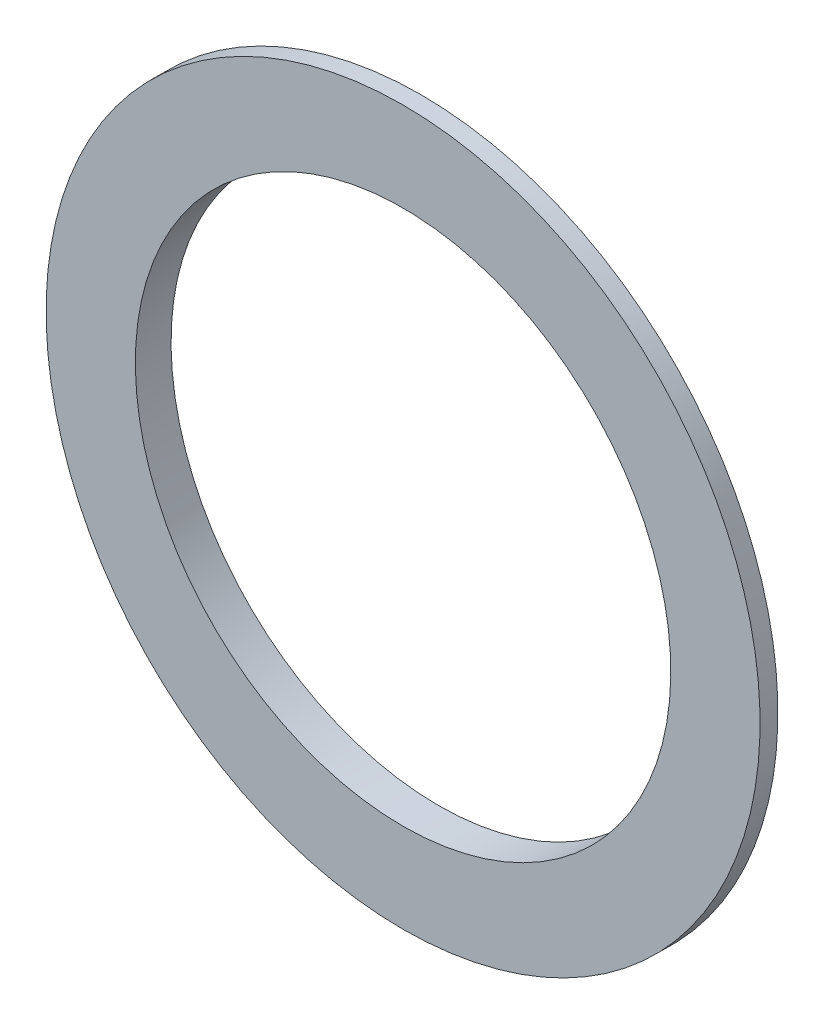
ISO-10303-21;
HEADER;
FILE_DESCRIPTION(('STEP AP214'),'2;1');
FILE_NAME('part.step','',(''),(''),'','','');
FILE_SCHEMA(('AUTOMOTIVE_DESIGN { 1 0 10303 214 1 1 1 1 }'));
ENDSEC;
DATA;
#1=APPLICATION_CONTEXT('core data for automotive mechanical design processes');
#2=APPLICATION_PROTOCOL_DEFINITION('international standard','automotive_design',2000,#1);
#3=PRODUCT_CONTEXT('',#1,'mechanical');
#4=PRODUCT('Part','Part','',(#3));
#5=PRODUCT_RELATED_PRODUCT_CATEGORY('part','',(#4));
#6=PRODUCT_DEFINITION_FORMATION('','',#4);
#7=PRODUCT_DEFINITION_CONTEXT('part definition',#1,'design');
#8=PRODUCT_DEFINITION('design','',#6,#7);
#9=PRODUCT_DEFINITION_SHAPE('','',#8);
#10=(LENGTH_UNIT() NAMED_UNIT(*) SI_UNIT(.MILLI.,.METRE.));
#11=(NAMED_UNIT(*) PLANE_ANGLE_UNIT() SI_UNIT($,.RADIAN.));
#12=(NAMED_UNIT(*) SI_UNIT($,.STERADIAN.) SOLID_ANGLE_UNIT());
#13=UNCERTAINTY_MEASURE_WITH_UNIT(LENGTH_MEASURE(1.E-05),#10,'distance_accuracy_value','');
#14=(GEOMETRIC_REPRESENTATION_CONTEXT(3) GLOBAL_UNCERTAINTY_ASSIGNED_CONTEXT((#13)) GLOBAL_UNIT_ASSIGNED_CONTEXT((#10,
#11,#12)) REPRESENTATION_CONTEXT('',''));
#15=CARTESIAN_POINT('',(0.,0.,0.));
#16=DIRECTION('',(0.,0.,1.));
#17=DIRECTION('',(1.,0.,0.));
#18=AXIS2_PLACEMENT_3D('',#15,#16,#17);
#19=CARTESIAN_POINT('',(0.,47.625,3.175));
#20=DIRECTION('',(0.,0.,-1.));
#21=DIRECTION('',(0.,1.,0.));
#22=AXIS2_PLACEMENT_3D('',#19,#20,#21);
#23=PLANE('',#22);
#24=CARTESIAN_POINT('',(0.,0.,3.17499999999999));
#25=DIRECTION('',(0.,0.,1.));
#26=DIRECTION('',(0.,-1.,0.));
#27=AXIS2_PLACEMENT_3D('',#24,#25,#26);
#28=CIRCLE('',#27,47.625);
#29=CARTESIAN_POINT('',(0.,-47.625,3.17499999999998));
#30=VERTEX_POINT('',#29);
#31=EDGE_CURVE('E65',#30,#30,#28,.T.);
#32=ORIENTED_EDGE('',*,*,#31,.F.);
#33=EDGE_LOOP('',(#32));
#34=FACE_BOUND('',#33,.T.);
#35=CARTESIAN_POINT('',(0.,0.,3.17499999999999));
#36=DIRECTION('',(0.,0.,1.));
#37=DIRECTION('',(0.,-1.,0.));
#38=AXIS2_PLACEMENT_3D('',#35,#36,#37);
#39=CIRCLE('',#38,63.5);
#40=CARTESIAN_POINT('',(0.,-63.5,3.17499999999998));
#41=VERTEX_POINT('',#40);
#42=EDGE_CURVE('E10',#41,#41,#39,.T.);
#43=ORIENTED_EDGE('',*,*,#42,.T.);
#44=EDGE_LOOP('',(#43));
#45=FACE_BOUND('',#44,.T.);
#46=ADVANCED_FACE('F31',(#34,#45),#23,.F.);
#47=CARTESIAN_POINT('',(0.,0.,3.175));
#48=DIRECTION('',(0.,0.,1.));
#49=DIRECTION('',(0.,-1.,0.));
#50=AXIS2_PLACEMENT_3D('',#47,#48,#49);
#51=CYLINDRICAL_SURFACE('',#50,63.5);
#52=ORIENTED_EDGE('',*,*,#42,.F.);
#53=EDGE_LOOP('',(#52));
#54=FACE_BOUND('',#53,.T.);
#55=CARTESIAN_POINT('',(0.,0.,0.));
#56=DIRECTION('',(0.,0.,1.));
#57=DIRECTION('',(0.,-1.,0.));
#58=AXIS2_PLACEMENT_3D('',#55,#56,#57);
#59=CIRCLE('',#58,63.5);
#60=CARTESIAN_POINT('',(0.,-63.5,0.));
#61=VERTEX_POINT('',#60);
#62=EDGE_CURVE('E37',#61,#61,#59,.T.);
#63=ORIENTED_EDGE('',*,*,#62,.T.);
#64=EDGE_LOOP('',(#63));
#65=FACE_BOUND('',#64,.T.);
#66=ADVANCED_FACE('F72',(#54,#65),#51,.T.);
#67=CARTESIAN_POINT('',(0.,63.5,0.));
#68=DIRECTION('',(0.,0.,1.));
#69=DIRECTION('',(0.,-1.,0.));
#70=AXIS2_PLACEMENT_3D('',#67,#68,#69);
#71=PLANE('',#70);
#72=ORIENTED_EDGE('',*,*,#62,.F.);
#73=EDGE_LOOP('',(#72));
#74=FACE_BOUND('',#73,.T.);
#75=CARTESIAN_POINT('',(0.,0.,0.));
#76=DIRECTION('',(0.,0.,1.));
#77=DIRECTION('',(0.,-1.,0.));
#78=AXIS2_PLACEMENT_3D('',#75,#76,#77);
#79=CIRCLE('',#78,57.15);
#80=CARTESIAN_POINT('',(0.,-57.15,0.));
#81=VERTEX_POINT('',#80);
#82=EDGE_CURVE('E41',#81,#81,#79,.T.);
#83=ORIENTED_EDGE('',*,*,#82,.T.);
#84=EDGE_LOOP('',(#83));
#85=FACE_BOUND('',#84,.T.);
#86=ADVANCED_FACE('F76',(#74,#85),#71,.F.);
#87=CARTESIAN_POINT('',(0.,0.,3.175));
#88=DIRECTION('',(0.,0.,1.));
#89=DIRECTION('',(0.,-1.,0.));
#90=AXIS2_PLACEMENT_3D('',#87,#88,#89);
#91=CYLINDRICAL_SURFACE('',#90,57.15);
#92=ORIENTED_EDGE('',*,*,#82,.F.);
#93=EDGE_LOOP('',(#92));
#94=FACE_BOUND('',#93,.T.);
#95=CARTESIAN_POINT('',(0.,0.,-3.17500000000001));
#96=DIRECTION('',(0.,0.,1.));
#97=DIRECTION('',(0.,-1.,0.));
#98=AXIS2_PLACEMENT_3D('',#95,#96,#97);
#99=CIRCLE('',#98,57.15);
#100=CARTESIAN_POINT('',(0.,-57.15,-3.17500000000002));
#101=VERTEX_POINT('',#100);
#102=EDGE_CURVE('E45',#101,#101,#99,.T.);
#103=ORIENTED_EDGE('',*,*,#102,.T.);
#104=EDGE_LOOP('',(#103));
#105=FACE_BOUND('',#104,.T.);
#106=ADVANCED_FACE('F81',(#94,#105),#91,.T.);
#107=CARTESIAN_POINT('',(0.,57.15,-3.175));
#108=DIRECTION('',(0.,0.,1.));
#109=DIRECTION('',(0.,-1.,0.));
#110=AXIS2_PLACEMENT_3D('',#107,#108,#109);
#111=PLANE('',#110);
#112=ORIENTED_EDGE('',*,*,#102,.F.);
#113=EDGE_LOOP('',(#112));
#114=FACE_BOUND('',#113,.T.);
#115=CARTESIAN_POINT('',(0.,0.,-3.17500000000001));
#116=DIRECTION('',(0.,0.,1.));
#117=DIRECTION('',(0.,-1.,0.));
#118=AXIS2_PLACEMENT_3D('',#115,#116,#117);
#119=CIRCLE('',#118,53.975);
#120=CARTESIAN_POINT('',(0.,-53.975,-3.17500000000002));
#121=VERTEX_POINT('',#120);
#122=EDGE_CURVE('E50',#121,#121,#119,.T.);
#123=ORIENTED_EDGE('',*,*,#122,.T.);
#124=EDGE_LOOP('',(#123));
#125=FACE_BOUND('',#124,.T.);
#126=ADVANCED_FACE('F87',(#114,#125),#111,.F.);
#127=CARTESIAN_POINT('',(0.,0.,3.175));
#128=DIRECTION('',(0.,0.,1.));
#129=DIRECTION('',(0.,-1.,0.));
#130=AXIS2_PLACEMENT_3D('',#127,#128,#129);
#131=CYLINDRICAL_SURFACE('',#130,53.975);
#132=ORIENTED_EDGE('',*,*,#122,.F.);
#133=EDGE_LOOP('',(#132));
#134=FACE_BOUND('',#133,.T.);
#135=CARTESIAN_POINT('',(0.,0.,0.));
#136=DIRECTION('',(0.,0.,1.));
#137=DIRECTION('',(0.,-1.,0.));
#138=AXIS2_PLACEMENT_3D('',#135,#136,#137);
#139=CIRCLE('',#138,53.975);
#140=CARTESIAN_POINT('',(0.,-53.975,0.));
#141=VERTEX_POINT('',#140);
#142=EDGE_CURVE('E53',#141,#141,#139,.T.);
#143=ORIENTED_EDGE('',*,*,#142,.T.);
#144=EDGE_LOOP('',(#143));
#145=FACE_BOUND('',#144,.T.);
#146=ADVANCED_FACE('F91',(#134,#145),#131,.F.);
#147=CARTESIAN_POINT('',(0.,53.975,0.));
#148=DIRECTION('',(0.,0.,1.));
#149=DIRECTION('',(0.,-1.,0.));
#150=AXIS2_PLACEMENT_3D('',#147,#148,#149);
#151=PLANE('',#150);
#152=ORIENTED_EDGE('',*,*,#142,.F.);
#153=EDGE_LOOP('',(#152));
#154=FACE_BOUND('',#153,.T.);
#155=CARTESIAN_POINT('',(0.,0.,0.));
#156=DIRECTION('',(0.,0.,1.));
#157=DIRECTION('',(0.,-1.,0.));
#158=AXIS2_PLACEMENT_3D('',#155,#156,#157);
#159=CIRCLE('',#158,50.8);
#160=CARTESIAN_POINT('',(0.,-50.8,0.));
#161=VERTEX_POINT('',#160);
#162=EDGE_CURVE('E56',#161,#161,#159,.T.);
#163=ORIENTED_EDGE('',*,*,#162,.T.);
#164=EDGE_LOOP('',(#163));
#165=FACE_BOUND('',#164,.T.);
#166=ADVANCED_FACE('F95',(#154,#165),#151,.F.);
#167=CARTESIAN_POINT('',(0.,0.,3.175));
#168=DIRECTION('',(0.,0.,1.));
#169=DIRECTION('',(0.,-1.,0.));
#170=AXIS2_PLACEMENT_3D('',#167,#168,#169);
#171=CYLINDRICAL_SURFACE('',#170,50.8);
#172=ORIENTED_EDGE('',*,*,#162,.F.);
#173=EDGE_LOOP('',(#172));
#174=FACE_BOUND('',#173,.T.);
#175=CARTESIAN_POINT('',(0.,0.,-3.17500000000001));
#176=DIRECTION('',(0.,0.,1.));
#177=DIRECTION('',(0.,-1.,0.));
#178=AXIS2_PLACEMENT_3D('',#175,#176,#177);
#179=CIRCLE('',#178,50.8);
#180=CARTESIAN_POINT('',(0.,-50.8,-3.17500000000002));
#181=VERTEX_POINT('',#180);
#182=EDGE_CURVE('E59',#181,#181,#179,.T.);
#183=ORIENTED_EDGE('',*,*,#182,.T.);
#184=EDGE_LOOP('',(#183));
#185=FACE_BOUND('',#184,.T.);
#186=ADVANCED_FACE('F99',(#174,#185),#171,.T.);
#187=CARTESIAN_POINT('',(0.,50.8,-3.17499999999999));
#188=DIRECTION('',(0.,0.,1.));
#189=DIRECTION('',(0.,-1.,0.));
#190=AXIS2_PLACEMENT_3D('',#187,#188,#189);
#191=PLANE('',#190);
#192=ORIENTED_EDGE('',*,*,#182,.F.);
#193=EDGE_LOOP('',(#192));
#194=FACE_BOUND('',#193,.T.);
#195=CARTESIAN_POINT('',(0.,0.,-3.17499999999999));
#196=DIRECTION('',(0.,0.,1.));
#197=DIRECTION('',(0.,-1.,0.));
#198=AXIS2_PLACEMENT_3D('',#195,#196,#197);
#199=CIRCLE('',#198,47.625);
#200=CARTESIAN_POINT('',(0.,-47.625,-3.175));
#201=VERTEX_POINT('',#200);
#202=EDGE_CURVE('E62',#201,#201,#199,.T.);
#203=ORIENTED_EDGE('',*,*,#202,.T.);
#204=EDGE_LOOP('',(#203));
#205=FACE_BOUND('',#204,.T.);
#206=ADVANCED_FACE('F103',(#194,#205),#191,.F.);
#207=CARTESIAN_POINT('',(0.,0.,3.175));
#208=DIRECTION('',(0.,0.,1.));
#209=DIRECTION('',(0.,-1.,0.));
#210=AXIS2_PLACEMENT_3D('',#207,#208,#209);
#211=CYLINDRICAL_SURFACE('',#210,47.625);
#212=ORIENTED_EDGE('',*,*,#202,.F.);
#213=EDGE_LOOP('',(#212));
#214=FACE_BOUND('',#213,.T.);
#215=ORIENTED_EDGE('',*,*,#31,.T.);
#216=EDGE_LOOP('',(#215));
#217=FACE_BOUND('',#216,.T.);
#218=ADVANCED_FACE('F69',(#214,#217),#211,.F.);
#219=CLOSED_SHELL('',(#46,#66,#86,#106,#126,#146,#166,#186,#206,#218));
#220=MANIFOLD_SOLID_BREP('B2',#219);
#221=ADVANCED_BREP_SHAPE_REPRESENTATION('',(#18,#220),#14);
#222=SHAPE_DEFINITION_REPRESENTATION(#9,#221);
ENDSEC;
END-ISO-10303-21;
